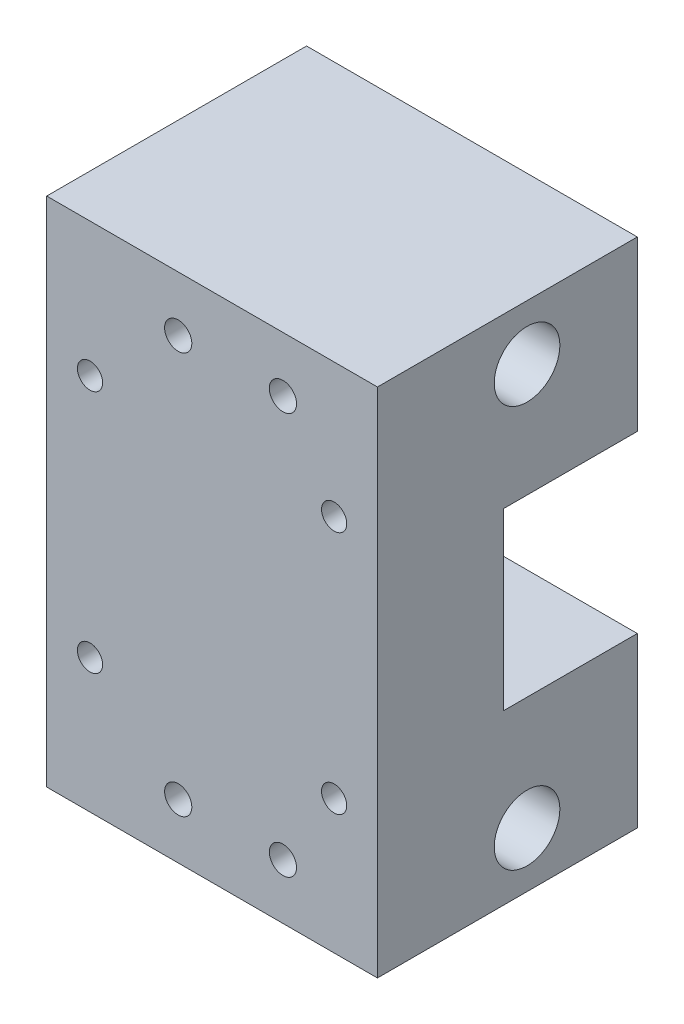
ISO-10303-21;
HEADER;
FILE_DESCRIPTION(('STEP AP214'),'2;1');
FILE_NAME('part.step','',(''),(''),'','','');
FILE_SCHEMA(('AUTOMOTIVE_DESIGN { 1 0 10303 214 1 1 1 1 }'));
ENDSEC;
DATA;
#1=APPLICATION_CONTEXT('core data for automotive mechanical design processes');
#2=APPLICATION_PROTOCOL_DEFINITION('international standard','automotive_design',2000,#1);
#3=PRODUCT_CONTEXT('',#1,'mechanical');
#4=PRODUCT('Part','Part','',(#3));
#5=PRODUCT_RELATED_PRODUCT_CATEGORY('part','',(#4));
#6=PRODUCT_DEFINITION_FORMATION('','',#4);
#7=PRODUCT_DEFINITION_CONTEXT('part definition',#1,'design');
#8=PRODUCT_DEFINITION('design','',#6,#7);
#9=PRODUCT_DEFINITION_SHAPE('','',#8);
#10=(LENGTH_UNIT() NAMED_UNIT(*) SI_UNIT(.MILLI.,.METRE.));
#11=(NAMED_UNIT(*) PLANE_ANGLE_UNIT() SI_UNIT($,.RADIAN.));
#12=(NAMED_UNIT(*) SI_UNIT($,.STERADIAN.) SOLID_ANGLE_UNIT());
#13=UNCERTAINTY_MEASURE_WITH_UNIT(LENGTH_MEASURE(1.E-05),#10,'distance_accuracy_value','');
#14=(GEOMETRIC_REPRESENTATION_CONTEXT(3) GLOBAL_UNCERTAINTY_ASSIGNED_CONTEXT((#13)) GLOBAL_UNIT_ASSIGNED_CONTEXT((#10,
#11,#12)) REPRESENTATION_CONTEXT('',''));
#15=CARTESIAN_POINT('',(0.,0.,0.));
#16=DIRECTION('',(0.,0.,1.));
#17=DIRECTION('',(1.,0.,0.));
#18=AXIS2_PLACEMENT_3D('',#15,#16,#17);
#19=CARTESIAN_POINT('',(21.,32.5,17.));
#20=DIRECTION('',(0.,0.,1.));
#21=DIRECTION('',(1.,0.,0.));
#22=AXIS2_PLACEMENT_3D('',#19,#20,#21);
#23=CYLINDRICAL_SURFACE('',#22,5.5);
#24=CARTESIAN_POINT('',(21.,32.5,17.));
#25=DIRECTION('',(0.,0.,1.));
#26=DIRECTION('',(1.,0.,0.));
#27=AXIS2_PLACEMENT_3D('',#24,#25,#26);
#28=CIRCLE('',#27,5.5);
#29=CARTESIAN_POINT('',(26.5,32.5,17.));
#30=VERTEX_POINT('',#29);
#31=EDGE_CURVE('E135',#30,#30,#28,.T.);
#32=ORIENTED_EDGE('',*,*,#31,.F.);
#33=EDGE_LOOP('',(#32));
#34=FACE_BOUND('',#33,.T.);
#35=CARTESIAN_POINT('',(21.,32.5,29.));
#36=DIRECTION('',(0.,0.,1.));
#37=DIRECTION('',(1.,0.,0.));
#38=AXIS2_PLACEMENT_3D('',#35,#36,#37);
#39=CIRCLE('',#38,5.5);
#40=CARTESIAN_POINT('',(26.5,32.5,29.));
#41=VERTEX_POINT('',#40);
#42=EDGE_CURVE('E11',#41,#41,#39,.F.);
#43=ORIENTED_EDGE('',*,*,#42,.F.);
#44=EDGE_LOOP('',(#43));
#45=FACE_BOUND('',#44,.T.);
#46=ADVANCED_FACE('F33',(#34,#45),#23,.F.);
#47=CARTESIAN_POINT('',(0.,0.,0.));
#48=DIRECTION('',(0.,0.,1.));
#49=DIRECTION('',(1.,0.,0.));
#50=AXIS2_PLACEMENT_3D('',#47,#48,#49);
#51=PLANE('',#50);
#52=CARTESIAN_POINT('',(36.5,17.,0.));
#53=DIRECTION('',(0.,0.,-1.));
#54=DIRECTION('',(-1.,0.,0.));
#55=AXIS2_PLACEMENT_3D('',#52,#53,#54);
#56=CIRCLE('',#55,3.);
#57=CARTESIAN_POINT('',(33.5,17.,0.));
#58=VERTEX_POINT('',#57);
#59=EDGE_CURVE('E326',#58,#58,#56,.T.);
#60=ORIENTED_EDGE('',*,*,#59,.F.);
#61=EDGE_LOOP('',(#60));
#62=FACE_BOUND('',#61,.T.);
#63=CARTESIAN_POINT('',(30.,7.,0.));
#64=DIRECTION('',(0.,0.,-1.));
#65=DIRECTION('',(-1.,0.,0.));
#66=AXIS2_PLACEMENT_3D('',#63,#64,#65);
#67=CIRCLE('',#66,1.72719999999998);
#68=CARTESIAN_POINT('',(28.2728,7.,0.));
#69=VERTEX_POINT('',#68);
#70=EDGE_CURVE('E290',#69,#69,#67,.T.);
#71=ORIENTED_EDGE('',*,*,#70,.F.);
#72=EDGE_LOOP('',(#71));
#73=FACE_BOUND('',#72,.T.);
#74=CARTESIAN_POINT('',(16.7,7.,0.));
#75=DIRECTION('',(0.,0.,-1.));
#76=DIRECTION('',(-1.,0.,0.));
#77=AXIS2_PLACEMENT_3D('',#74,#75,#76);
#78=CIRCLE('',#77,1.72719999999998);
#79=CARTESIAN_POINT('',(14.9728,7.,0.));
#80=VERTEX_POINT('',#79);
#81=EDGE_CURVE('E287',#80,#80,#78,.T.);
#82=ORIENTED_EDGE('',*,*,#81,.F.);
#83=EDGE_LOOP('',(#82));
#84=FACE_BOUND('',#83,.T.);
#85=DIRECTION('',(0.,-1.,0.));
#86=VECTOR('',#85,1.);
#87=CARTESIAN_POINT('',(0.,65.,0.));
#88=LINE('',#87,#86);
#89=CARTESIAN_POINT('',(0.,21.3875,0.));
#90=VERTEX_POINT('',#89);
#91=CARTESIAN_POINT('',(0.,0.,0.));
#92=VERTEX_POINT('',#91);
#93=EDGE_CURVE('E106',#90,#92,#88,.T.);
#94=ORIENTED_EDGE('',*,*,#93,.F.);
#95=DIRECTION('',(1.,0.,0.));
#96=VECTOR('',#95,1.);
#97=CARTESIAN_POINT('',(0.,21.3875,0.));
#98=LINE('',#97,#96);
#99=CARTESIAN_POINT('',(42.,21.3875,0.));
#100=VERTEX_POINT('',#99);
#101=EDGE_CURVE('E259',#90,#100,#98,.T.);
#102=ORIENTED_EDGE('',*,*,#101,.T.);
#103=DIRECTION('',(0.,1.,0.));
#104=VECTOR('',#103,1.);
#105=CARTESIAN_POINT('',(42.,0.,0.));
#106=LINE('',#105,#104);
#107=CARTESIAN_POINT('',(42.,0.,0.));
#108=VERTEX_POINT('',#107);
#109=EDGE_CURVE('E244',#108,#100,#106,.T.);
#110=ORIENTED_EDGE('',*,*,#109,.F.);
#111=DIRECTION('',(1.,0.,0.));
#112=VECTOR('',#111,1.);
#113=CARTESIAN_POINT('',(0.,0.,0.));
#114=LINE('',#113,#112);
#115=EDGE_CURVE('E250',#92,#108,#114,.T.);
#116=ORIENTED_EDGE('',*,*,#115,.F.);
#117=EDGE_LOOP('',(#94,#102,#110,#116));
#118=FACE_BOUND('',#117,.T.);
#119=CARTESIAN_POINT('',(5.5,17.,0.));
#120=DIRECTION('',(0.,0.,-1.));
#121=DIRECTION('',(-1.,0.,0.));
#122=AXIS2_PLACEMENT_3D('',#119,#120,#121);
#123=CIRCLE('',#122,3.);
#124=CARTESIAN_POINT('',(2.5,17.,0.));
#125=VERTEX_POINT('',#124);
#126=EDGE_CURVE('E317',#125,#125,#123,.T.);
#127=ORIENTED_EDGE('',*,*,#126,.F.);
#128=EDGE_LOOP('',(#127));
#129=FACE_BOUND('',#128,.T.);
#130=ADVANCED_FACE('F163',(#62,#73,#84,#118,#129),#51,.F.);
#131=CARTESIAN_POINT('',(42.,65.,0.));
#132=DIRECTION('',(0.,1.,0.));
#133=DIRECTION('',(0.,0.,1.));
#134=AXIS2_PLACEMENT_3D('',#131,#132,#133);
#135=PLANE('',#134);
#136=DIRECTION('',(0.,0.,1.));
#137=VECTOR('',#136,1.);
#138=CARTESIAN_POINT('',(0.,65.,0.));
#139=LINE('',#138,#137);
#140=CARTESIAN_POINT('',(0.,65.,0.));
#141=VERTEX_POINT('',#140);
#142=CARTESIAN_POINT('',(0.,65.,33.));
#143=VERTEX_POINT('',#142);
#144=EDGE_CURVE('E111',#141,#143,#139,.T.);
#145=ORIENTED_EDGE('',*,*,#144,.T.);
#146=DIRECTION('',(-1.,0.,0.));
#147=VECTOR('',#146,1.);
#148=CARTESIAN_POINT('',(0.,65.,33.));
#149=LINE('',#148,#147);
#150=CARTESIAN_POINT('',(42.,65.,33.));
#151=VERTEX_POINT('',#150);
#152=EDGE_CURVE('E125',#151,#143,#149,.T.);
#153=ORIENTED_EDGE('',*,*,#152,.F.);
#154=DIRECTION('',(0.,0.,1.));
#155=VECTOR('',#154,1.);
#156=CARTESIAN_POINT('',(42.,65.,0.));
#157=LINE('',#156,#155);
#158=CARTESIAN_POINT('',(42.,65.,0.));
#159=VERTEX_POINT('',#158);
#160=EDGE_CURVE('E41',#159,#151,#157,.T.);
#161=ORIENTED_EDGE('',*,*,#160,.F.);
#162=DIRECTION('',(-1.,0.,0.));
#163=VECTOR('',#162,1.);
#164=CARTESIAN_POINT('',(42.,65.,0.));
#165=LINE('',#164,#163);
#166=EDGE_CURVE('E255',#159,#141,#165,.T.);
#167=ORIENTED_EDGE('',*,*,#166,.T.);
#168=EDGE_LOOP('',(#145,#153,#161,#167));
#169=FACE_BOUND('',#168,.T.);
#170=ADVANCED_FACE('F35',(#169),#135,.T.);
#171=CARTESIAN_POINT('',(42.,0.,0.));
#172=DIRECTION('',(1.,0.,0.));
#173=DIRECTION('',(0.,0.,-1.));
#174=AXIS2_PLACEMENT_3D('',#171,#172,#173);
#175=PLANE('',#174);
#176=CARTESIAN_POINT('',(42.,7.,14.));
#177=DIRECTION('',(1.,0.,0.));
#178=DIRECTION('',(0.,0.,-1.));
#179=AXIS2_PLACEMENT_3D('',#176,#177,#178);
#180=CIRCLE('',#179,4.16718750000001);
#181=CARTESIAN_POINT('',(42.,7.,9.83281249999999));
#182=VERTEX_POINT('',#181);
#183=EDGE_CURVE('E337',#182,#182,#180,.T.);
#184=ORIENTED_EDGE('',*,*,#183,.F.);
#185=EDGE_LOOP('',(#184));
#186=FACE_BOUND('',#185,.T.);
#187=CARTESIAN_POINT('',(42.,58.,14.));
#188=DIRECTION('',(1.,0.,0.));
#189=DIRECTION('',(0.,0.,-1.));
#190=AXIS2_PLACEMENT_3D('',#187,#188,#189);
#191=CIRCLE('',#190,4.16718750000002);
#192=CARTESIAN_POINT('',(42.,58.,9.83281249999998));
#193=VERTEX_POINT('',#192);
#194=EDGE_CURVE('E332',#193,#193,#191,.T.);
#195=ORIENTED_EDGE('',*,*,#194,.F.);
#196=EDGE_LOOP('',(#195));
#197=FACE_BOUND('',#196,.T.);
#198=DIRECTION('',(0.,0.,-1.));
#199=VECTOR('',#198,1.);
#200=CARTESIAN_POINT('',(42.,21.3875,17.));
#201=LINE('',#200,#199);
#202=CARTESIAN_POINT('',(42.,21.3875,17.));
#203=VERTEX_POINT('',#202);
#204=EDGE_CURVE('E274',#203,#100,#201,.T.);
#205=ORIENTED_EDGE('',*,*,#204,.F.);
#206=DIRECTION('',(0.,-1.,0.));
#207=VECTOR('',#206,1.);
#208=CARTESIAN_POINT('',(42.,43.6125,17.));
#209=LINE('',#208,#207);
#210=CARTESIAN_POINT('',(42.,43.6125,17.));
#211=VERTEX_POINT('',#210);
#212=EDGE_CURVE('E267',#211,#203,#209,.T.);
#213=ORIENTED_EDGE('',*,*,#212,.F.);
#214=DIRECTION('',(0.,0.,1.));
#215=VECTOR('',#214,1.);
#216=CARTESIAN_POINT('',(42.,43.6125,0.));
#217=LINE('',#216,#215);
#218=CARTESIAN_POINT('',(42.,43.6125,0.));
#219=VERTEX_POINT('',#218);
#220=EDGE_CURVE('E271',#219,#211,#217,.T.);
#221=ORIENTED_EDGE('',*,*,#220,.F.);
#222=EDGE_CURVE('E56',#219,#159,#106,.T.);
#223=ORIENTED_EDGE('',*,*,#222,.T.);
#224=ORIENTED_EDGE('',*,*,#160,.T.);
#225=DIRECTION('',(0.,1.,0.));
#226=VECTOR('',#225,1.);
#227=CARTESIAN_POINT('',(42.,0.,33.));
#228=LINE('',#227,#226);
#229=CARTESIAN_POINT('',(42.,0.,33.));
#230=VERTEX_POINT('',#229);
#231=EDGE_CURVE('E119',#230,#151,#228,.T.);
#232=ORIENTED_EDGE('',*,*,#231,.F.);
#233=DIRECTION('',(0.,0.,1.));
#234=VECTOR('',#233,1.);
#235=CARTESIAN_POINT('',(42.,0.,0.));
#236=LINE('',#235,#234);
#237=EDGE_CURVE('E110',#108,#230,#236,.T.);
#238=ORIENTED_EDGE('',*,*,#237,.F.);
#239=ORIENTED_EDGE('',*,*,#109,.T.);
#240=EDGE_LOOP('',(#205,#213,#221,#223,#224,#232,#238,#239));
#241=FACE_BOUND('',#240,.T.);
#242=ADVANCED_FACE('F410',(#186,#197,#241),#175,.T.);
#243=CARTESIAN_POINT('',(0.,0.,0.));
#244=DIRECTION('',(0.,-1.,0.));
#245=DIRECTION('',(0.,0.,-1.));
#246=AXIS2_PLACEMENT_3D('',#243,#244,#245);
#247=PLANE('',#246);
#248=ORIENTED_EDGE('',*,*,#237,.T.);
#249=DIRECTION('',(1.,0.,0.));
#250=VECTOR('',#249,1.);
#251=CARTESIAN_POINT('',(0.,0.,33.));
#252=LINE('',#251,#250);
#253=CARTESIAN_POINT('',(0.,0.,33.));
#254=VERTEX_POINT('',#253);
#255=EDGE_CURVE('E114',#254,#230,#252,.T.);
#256=ORIENTED_EDGE('',*,*,#255,.F.);
#257=DIRECTION('',(0.,0.,1.));
#258=VECTOR('',#257,1.);
#259=CARTESIAN_POINT('',(0.,0.,0.));
#260=LINE('',#259,#258);
#261=EDGE_CURVE('E99',#92,#254,#260,.T.);
#262=ORIENTED_EDGE('',*,*,#261,.F.);
#263=ORIENTED_EDGE('',*,*,#115,.T.);
#264=EDGE_LOOP('',(#248,#256,#262,#263));
#265=FACE_BOUND('',#264,.T.);
#266=ADVANCED_FACE('F115',(#265),#247,.T.);
#267=CARTESIAN_POINT('',(0.,65.,0.));
#268=DIRECTION('',(-1.,0.,0.));
#269=DIRECTION('',(0.,-1.,0.));
#270=AXIS2_PLACEMENT_3D('',#267,#268,#269);
#271=PLANE('',#270);
#272=DIRECTION('',(0.,0.,-1.));
#273=VECTOR('',#272,1.);
#274=CARTESIAN_POINT('',(0.,21.3875,17.));
#275=LINE('',#274,#273);
#276=CARTESIAN_POINT('',(0.,21.3875,17.));
#277=VERTEX_POINT('',#276);
#278=EDGE_CURVE('E270',#277,#90,#275,.T.);
#279=ORIENTED_EDGE('',*,*,#278,.T.);
#280=ORIENTED_EDGE('',*,*,#93,.T.);
#281=ORIENTED_EDGE('',*,*,#261,.T.);
#282=DIRECTION('',(0.,-1.,0.));
#283=VECTOR('',#282,1.);
#284=CARTESIAN_POINT('',(0.,0.,33.));
#285=LINE('',#284,#283);
#286=EDGE_CURVE('E104',#143,#254,#285,.T.);
#287=ORIENTED_EDGE('',*,*,#286,.F.);
#288=ORIENTED_EDGE('',*,*,#144,.F.);
#289=CARTESIAN_POINT('',(0.,43.6125,0.));
#290=VERTEX_POINT('',#289);
#291=EDGE_CURVE('E252',#141,#290,#88,.T.);
#292=ORIENTED_EDGE('',*,*,#291,.T.);
#293=DIRECTION('',(0.,0.,1.));
#294=VECTOR('',#293,1.);
#295=CARTESIAN_POINT('',(0.,43.6125,0.));
#296=LINE('',#295,#294);
#297=CARTESIAN_POINT('',(0.,43.6125,17.));
#298=VERTEX_POINT('',#297);
#299=EDGE_CURVE('E48',#290,#298,#296,.T.);
#300=ORIENTED_EDGE('',*,*,#299,.T.);
#301=DIRECTION('',(0.,-1.,0.));
#302=VECTOR('',#301,1.);
#303=CARTESIAN_POINT('',(0.,43.6125,17.));
#304=LINE('',#303,#302);
#305=EDGE_CURVE('E262',#298,#277,#304,.T.);
#306=ORIENTED_EDGE('',*,*,#305,.T.);
#307=EDGE_LOOP('',(#279,#280,#281,#287,#288,#292,#300,#306));
#308=FACE_BOUND('',#307,.T.);
#309=ADVANCED_FACE('F102',(#308),#271,.T.);
#310=CARTESIAN_POINT('',(5.5,48.,0.));
#311=DIRECTION('',(0.,0.,-1.));
#312=DIRECTION('',(-1.,0.,0.));
#313=AXIS2_PLACEMENT_3D('',#310,#311,#312);
#314=CIRCLE('',#313,3.);
#315=CARTESIAN_POINT('',(2.5,48.,0.));
#316=VERTEX_POINT('',#315);
#317=EDGE_CURVE('E308',#316,#316,#314,.T.);
#318=ORIENTED_EDGE('',*,*,#317,.F.);
#319=EDGE_LOOP('',(#318));
#320=FACE_BOUND('',#319,.T.);
#321=CARTESIAN_POINT('',(36.5,48.,0.));
#322=DIRECTION('',(0.,0.,-1.));
#323=DIRECTION('',(-1.,0.,0.));
#324=AXIS2_PLACEMENT_3D('',#321,#322,#323);
#325=CIRCLE('',#324,3.);
#326=CARTESIAN_POINT('',(33.5,48.,0.));
#327=VERTEX_POINT('',#326);
#328=EDGE_CURVE('E299',#327,#327,#325,.T.);
#329=ORIENTED_EDGE('',*,*,#328,.F.);
#330=EDGE_LOOP('',(#329));
#331=FACE_BOUND('',#330,.T.);
#332=CARTESIAN_POINT('',(16.7,58.,0.));
#333=DIRECTION('',(0.,0.,-1.));
#334=DIRECTION('',(-1.,0.,0.));
#335=AXIS2_PLACEMENT_3D('',#332,#333,#334);
#336=CIRCLE('',#335,1.72719999999998);
#337=CARTESIAN_POINT('',(14.9728,58.,0.));
#338=VERTEX_POINT('',#337);
#339=EDGE_CURVE('E284',#338,#338,#336,.T.);
#340=ORIENTED_EDGE('',*,*,#339,.F.);
#341=EDGE_LOOP('',(#340));
#342=FACE_BOUND('',#341,.T.);
#343=CARTESIAN_POINT('',(30.,58.,0.));
#344=DIRECTION('',(0.,0.,-1.));
#345=DIRECTION('',(-1.,0.,0.));
#346=AXIS2_PLACEMENT_3D('',#343,#344,#345);
#347=CIRCLE('',#346,1.72719999999998);
#348=CARTESIAN_POINT('',(28.2728,58.,0.));
#349=VERTEX_POINT('',#348);
#350=EDGE_CURVE('E277',#349,#349,#347,.T.);
#351=ORIENTED_EDGE('',*,*,#350,.F.);
#352=EDGE_LOOP('',(#351));
#353=FACE_BOUND('',#352,.T.);
#354=ORIENTED_EDGE('',*,*,#222,.F.);
#355=DIRECTION('',(1.,0.,0.));
#356=VECTOR('',#355,1.);
#357=CARTESIAN_POINT('',(0.,43.6125,0.));
#358=LINE('',#357,#356);
#359=EDGE_CURVE('E261',#290,#219,#358,.T.);
#360=ORIENTED_EDGE('',*,*,#359,.F.);
#361=ORIENTED_EDGE('',*,*,#291,.F.);
#362=ORIENTED_EDGE('',*,*,#166,.F.);
#363=EDGE_LOOP('',(#354,#360,#361,#362));
#364=FACE_BOUND('',#363,.T.);
#365=ADVANCED_FACE('F404',(#320,#331,#342,#353,#364),#51,.F.);
#366=CARTESIAN_POINT('',(0.,21.3875,17.));
#367=DIRECTION('',(0.,-1.,0.));
#368=DIRECTION('',(0.,0.,-1.));
#369=AXIS2_PLACEMENT_3D('',#366,#367,#368);
#370=PLANE('',#369);
#371=ORIENTED_EDGE('',*,*,#204,.T.);
#372=ORIENTED_EDGE('',*,*,#101,.F.);
#373=ORIENTED_EDGE('',*,*,#278,.F.);
#374=DIRECTION('',(1.,0.,0.));
#375=VECTOR('',#374,1.);
#376=CARTESIAN_POINT('',(0.,21.3875,17.));
#377=LINE('',#376,#375);
#378=EDGE_CURVE('E258',#277,#203,#377,.T.);
#379=ORIENTED_EDGE('',*,*,#378,.T.);
#380=EDGE_LOOP('',(#371,#372,#373,#379));
#381=FACE_BOUND('',#380,.T.);
#382=ADVANCED_FACE('F497',(#381),#370,.F.);
#383=CARTESIAN_POINT('',(0.,43.6125,17.));
#384=DIRECTION('',(0.,0.,1.));
#385=DIRECTION('',(1.,0.,0.));
#386=AXIS2_PLACEMENT_3D('',#383,#384,#385);
#387=PLANE('',#386);
#388=ORIENTED_EDGE('',*,*,#212,.T.);
#389=ORIENTED_EDGE('',*,*,#378,.F.);
#390=ORIENTED_EDGE('',*,*,#305,.F.);
#391=DIRECTION('',(1.,0.,0.));
#392=VECTOR('',#391,1.);
#393=CARTESIAN_POINT('',(0.,43.6125,17.));
#394=LINE('',#393,#392);
#395=EDGE_CURVE('E264',#298,#211,#394,.T.);
#396=ORIENTED_EDGE('',*,*,#395,.T.);
#397=EDGE_LOOP('',(#388,#389,#390,#396));
#398=FACE_BOUND('',#397,.T.);
#399=ORIENTED_EDGE('',*,*,#31,.T.);
#400=EDGE_LOOP('',(#399));
#401=FACE_BOUND('',#400,.T.);
#402=ADVANCED_FACE('F344',(#398,#401),#387,.F.);
#403=CARTESIAN_POINT('',(0.,43.6125,0.));
#404=DIRECTION('',(0.,1.,0.));
#405=DIRECTION('',(0.,0.,1.));
#406=AXIS2_PLACEMENT_3D('',#403,#404,#405);
#407=PLANE('',#406);
#408=ORIENTED_EDGE('',*,*,#359,.T.);
#409=ORIENTED_EDGE('',*,*,#220,.T.);
#410=ORIENTED_EDGE('',*,*,#395,.F.);
#411=ORIENTED_EDGE('',*,*,#299,.F.);
#412=EDGE_LOOP('',(#408,#409,#410,#411));
#413=FACE_BOUND('',#412,.T.);
#414=ADVANCED_FACE('F396',(#413),#407,.F.);
#415=CARTESIAN_POINT('',(30.,58.,0.));
#416=DIRECTION('',(0.,0.,-1.));
#417=DIRECTION('',(-1.,0.,0.));
#418=AXIS2_PLACEMENT_3D('',#415,#416,#417);
#419=CYLINDRICAL_SURFACE('',#418,1.72719999999998);
#420=ORIENTED_EDGE('',*,*,#350,.T.);
#421=EDGE_LOOP('',(#420));
#422=FACE_BOUND('',#421,.T.);
#423=CARTESIAN_POINT('',(30.,58.,33.));
#424=DIRECTION('',(0.,0.,1.));
#425=DIRECTION('',(1.,0.,0.));
#426=AXIS2_PLACEMENT_3D('',#423,#424,#425);
#427=CIRCLE('',#426,1.72719999999999);
#428=CARTESIAN_POINT('',(31.7272,58.,33.));
#429=VERTEX_POINT('',#428);
#430=EDGE_CURVE('E659',#429,#429,#427,.T.);
#431=ORIENTED_EDGE('',*,*,#430,.T.);
#432=EDGE_LOOP('',(#431));
#433=FACE_BOUND('',#432,.T.);
#434=ADVANCED_FACE('F389',(#422,#433),#419,.F.);
#435=CARTESIAN_POINT('',(16.7,58.,0.));
#436=DIRECTION('',(0.,0.,-1.));
#437=DIRECTION('',(-1.,0.,0.));
#438=AXIS2_PLACEMENT_3D('',#435,#436,#437);
#439=CYLINDRICAL_SURFACE('',#438,1.72719999999998);
#440=ORIENTED_EDGE('',*,*,#339,.T.);
#441=EDGE_LOOP('',(#440));
#442=FACE_BOUND('',#441,.T.);
#443=CARTESIAN_POINT('',(16.7,58.,33.));
#444=DIRECTION('',(0.,0.,1.));
#445=DIRECTION('',(1.,0.,0.));
#446=AXIS2_PLACEMENT_3D('',#443,#444,#445);
#447=CIRCLE('',#446,1.72719999999998);
#448=CARTESIAN_POINT('',(18.4272,58.,33.));
#449=VERTEX_POINT('',#448);
#450=EDGE_CURVE('E129',#449,#449,#447,.T.);
#451=ORIENTED_EDGE('',*,*,#450,.T.);
#452=EDGE_LOOP('',(#451));
#453=FACE_BOUND('',#452,.T.);
#454=ADVANCED_FACE('F382',(#442,#453),#439,.F.);
#455=CARTESIAN_POINT('',(16.7,7.,0.));
#456=DIRECTION('',(0.,0.,-1.));
#457=DIRECTION('',(-1.,0.,0.));
#458=AXIS2_PLACEMENT_3D('',#455,#456,#457);
#459=CYLINDRICAL_SURFACE('',#458,1.72719999999998);
#460=ORIENTED_EDGE('',*,*,#81,.T.);
#461=EDGE_LOOP('',(#460));
#462=FACE_BOUND('',#461,.T.);
#463=CARTESIAN_POINT('',(16.7,7.,33.));
#464=DIRECTION('',(0.,0.,1.));
#465=DIRECTION('',(1.,0.,0.));
#466=AXIS2_PLACEMENT_3D('',#463,#464,#465);
#467=CIRCLE('',#466,1.72719999999999);
#468=CARTESIAN_POINT('',(18.4272,7.,33.));
#469=VERTEX_POINT('',#468);
#470=EDGE_CURVE('E643',#469,#469,#467,.T.);
#471=ORIENTED_EDGE('',*,*,#470,.T.);
#472=EDGE_LOOP('',(#471));
#473=FACE_BOUND('',#472,.T.);
#474=ADVANCED_FACE('F232',(#462,#473),#459,.F.);
#475=CARTESIAN_POINT('',(30.,7.,0.));
#476=DIRECTION('',(0.,0.,-1.));
#477=DIRECTION('',(-1.,0.,0.));
#478=AXIS2_PLACEMENT_3D('',#475,#476,#477);
#479=CYLINDRICAL_SURFACE('',#478,1.72719999999998);
#480=CARTESIAN_POINT('',(30.,7.,21.));
#481=DIRECTION('',(0.,0.,-1.));
#482=DIRECTION('',(1.,0.,0.));
#483=AXIS2_PLACEMENT_3D('',#480,#481,#482);
#484=CIRCLE('',#483,1.72819691868454);
#485=CARTESIAN_POINT('',(31.7281969186845,7.,21.));
#486=VERTEX_POINT('',#485);
#487=EDGE_CURVE('E140',#486,#486,#484,.T.);
#488=ORIENTED_EDGE('',*,*,#487,.F.);
#489=EDGE_LOOP('',(#488));
#490=FACE_BOUND('',#489,.T.);
#491=ORIENTED_EDGE('',*,*,#70,.T.);
#492=EDGE_LOOP('',(#491));
#493=FACE_BOUND('',#492,.T.);
#494=ADVANCED_FACE('F227',(#490,#493),#479,.F.);
#495=CARTESIAN_POINT('',(36.5,48.,0.));
#496=DIRECTION('',(0.,0.,-1.));
#497=DIRECTION('',(-1.,0.,0.));
#498=AXIS2_PLACEMENT_3D('',#495,#496,#497);
#499=CYLINDRICAL_SURFACE('',#498,1.60000000000001);
#500=CARTESIAN_POINT('',(36.5,48.,7.62));
#501=DIRECTION('',(0.,0.,-1.));
#502=DIRECTION('',(-1.,0.,0.));
#503=AXIS2_PLACEMENT_3D('',#500,#501,#502);
#504=CIRCLE('',#503,1.60000000000001);
#505=CARTESIAN_POINT('',(34.9,48.,7.62));
#506=VERTEX_POINT('',#505);
#507=EDGE_CURVE('E293',#506,#506,#504,.T.);
#508=ORIENTED_EDGE('',*,*,#507,.T.);
#509=EDGE_LOOP('',(#508));
#510=FACE_BOUND('',#509,.T.);
#511=CARTESIAN_POINT('',(36.5,48.,33.));
#512=DIRECTION('',(0.,0.,1.));
#513=DIRECTION('',(1.,0.,0.));
#514=AXIS2_PLACEMENT_3D('',#511,#512,#513);
#515=CIRCLE('',#514,1.60000000000001);
#516=CARTESIAN_POINT('',(38.1,48.,33.));
#517=VERTEX_POINT('',#516);
#518=EDGE_CURVE('E656',#517,#517,#515,.T.);
#519=ORIENTED_EDGE('',*,*,#518,.T.);
#520=EDGE_LOOP('',(#519));
#521=FACE_BOUND('',#520,.T.);
#522=ADVANCED_FACE('F223',(#510,#521),#499,.F.);
#523=CARTESIAN_POINT('',(38.1,48.,7.62));
#524=DIRECTION('',(0.,0.,1.));
#525=DIRECTION('',(1.,0.,0.));
#526=AXIS2_PLACEMENT_3D('',#523,#524,#525);
#527=PLANE('',#526);
#528=ORIENTED_EDGE('',*,*,#507,.F.);
#529=EDGE_LOOP('',(#528));
#530=FACE_BOUND('',#529,.T.);
#531=CARTESIAN_POINT('',(36.5,48.,7.62));
#532=DIRECTION('',(0.,0.,-1.));
#533=DIRECTION('',(-1.,0.,0.));
#534=AXIS2_PLACEMENT_3D('',#531,#532,#533);
#535=CIRCLE('',#534,3.);
#536=CARTESIAN_POINT('',(33.5,48.,7.62));
#537=VERTEX_POINT('',#536);
#538=EDGE_CURVE('E296',#537,#537,#535,.T.);
#539=ORIENTED_EDGE('',*,*,#538,.T.);
#540=EDGE_LOOP('',(#539));
#541=FACE_BOUND('',#540,.T.);
#542=ADVANCED_FACE('F219',(#530,#541),#527,.F.);
#543=CARTESIAN_POINT('',(36.5,48.,0.));
#544=DIRECTION('',(0.,0.,-1.));
#545=DIRECTION('',(-1.,0.,0.));
#546=AXIS2_PLACEMENT_3D('',#543,#544,#545);
#547=CYLINDRICAL_SURFACE('',#546,3.);
#548=ORIENTED_EDGE('',*,*,#538,.F.);
#549=EDGE_LOOP('',(#548));
#550=FACE_BOUND('',#549,.T.);
#551=ORIENTED_EDGE('',*,*,#328,.T.);
#552=EDGE_LOOP('',(#551));
#553=FACE_BOUND('',#552,.T.);
#554=ADVANCED_FACE('F215',(#550,#553),#547,.F.);
#555=CARTESIAN_POINT('',(5.5,48.,0.));
#556=DIRECTION('',(0.,0.,-1.));
#557=DIRECTION('',(-1.,0.,0.));
#558=AXIS2_PLACEMENT_3D('',#555,#556,#557);
#559=CYLINDRICAL_SURFACE('',#558,1.6);
#560=CARTESIAN_POINT('',(5.5,48.,7.62));
#561=DIRECTION('',(0.,0.,-1.));
#562=DIRECTION('',(-1.,0.,0.));
#563=AXIS2_PLACEMENT_3D('',#560,#561,#562);
#564=CIRCLE('',#563,1.60000000000001);
#565=CARTESIAN_POINT('',(3.89999999999999,48.,7.62));
#566=VERTEX_POINT('',#565);
#567=EDGE_CURVE('E302',#566,#566,#564,.T.);
#568=ORIENTED_EDGE('',*,*,#567,.T.);
#569=EDGE_LOOP('',(#568));
#570=FACE_BOUND('',#569,.T.);
#571=CARTESIAN_POINT('',(5.5,48.,33.));
#572=DIRECTION('',(0.,0.,1.));
#573=DIRECTION('',(1.,0.,0.));
#574=AXIS2_PLACEMENT_3D('',#571,#572,#573);
#575=CIRCLE('',#574,1.6);
#576=CARTESIAN_POINT('',(7.1,48.,33.));
#577=VERTEX_POINT('',#576);
#578=EDGE_CURVE('E126',#577,#577,#575,.T.);
#579=ORIENTED_EDGE('',*,*,#578,.T.);
#580=EDGE_LOOP('',(#579));
#581=FACE_BOUND('',#580,.T.);
#582=ADVANCED_FACE('F211',(#570,#581),#559,.F.);
#583=CARTESIAN_POINT('',(7.10000000000001,48.,7.62));
#584=DIRECTION('',(0.,0.,1.));
#585=DIRECTION('',(1.,0.,0.));
#586=AXIS2_PLACEMENT_3D('',#583,#584,#585);
#587=PLANE('',#586);
#588=ORIENTED_EDGE('',*,*,#567,.F.);
#589=EDGE_LOOP('',(#588));
#590=FACE_BOUND('',#589,.T.);
#591=CARTESIAN_POINT('',(5.5,48.,7.62));
#592=DIRECTION('',(0.,0.,-1.));
#593=DIRECTION('',(-1.,0.,0.));
#594=AXIS2_PLACEMENT_3D('',#591,#592,#593);
#595=CIRCLE('',#594,3.);
#596=CARTESIAN_POINT('',(2.5,48.,7.62));
#597=VERTEX_POINT('',#596);
#598=EDGE_CURVE('E305',#597,#597,#595,.T.);
#599=ORIENTED_EDGE('',*,*,#598,.T.);
#600=EDGE_LOOP('',(#599));
#601=FACE_BOUND('',#600,.T.);
#602=ADVANCED_FACE('F207',(#590,#601),#587,.F.);
#603=CARTESIAN_POINT('',(5.5,48.,0.));
#604=DIRECTION('',(0.,0.,-1.));
#605=DIRECTION('',(-1.,0.,0.));
#606=AXIS2_PLACEMENT_3D('',#603,#604,#605);
#607=CYLINDRICAL_SURFACE('',#606,3.);
#608=ORIENTED_EDGE('',*,*,#598,.F.);
#609=EDGE_LOOP('',(#608));
#610=FACE_BOUND('',#609,.T.);
#611=ORIENTED_EDGE('',*,*,#317,.T.);
#612=EDGE_LOOP('',(#611));
#613=FACE_BOUND('',#612,.T.);
#614=ADVANCED_FACE('F203',(#610,#613),#607,.F.);
#615=CARTESIAN_POINT('',(5.5,17.,0.));
#616=DIRECTION('',(0.,0.,-1.));
#617=DIRECTION('',(-1.,0.,0.));
#618=AXIS2_PLACEMENT_3D('',#615,#616,#617);
#619=CYLINDRICAL_SURFACE('',#618,1.6);
#620=CARTESIAN_POINT('',(5.5,17.,7.62));
#621=DIRECTION('',(0.,0.,-1.));
#622=DIRECTION('',(-1.,0.,0.));
#623=AXIS2_PLACEMENT_3D('',#620,#621,#622);
#624=CIRCLE('',#623,1.60000000000001);
#625=CARTESIAN_POINT('',(3.89999999999999,17.,7.62));
#626=VERTEX_POINT('',#625);
#627=EDGE_CURVE('E311',#626,#626,#624,.T.);
#628=ORIENTED_EDGE('',*,*,#627,.T.);
#629=EDGE_LOOP('',(#628));
#630=FACE_BOUND('',#629,.T.);
#631=CARTESIAN_POINT('',(5.5,17.,33.));
#632=DIRECTION('',(0.,0.,1.));
#633=DIRECTION('',(1.,0.,0.));
#634=AXIS2_PLACEMENT_3D('',#631,#632,#633);
#635=CIRCLE('',#634,1.6);
#636=CARTESIAN_POINT('',(7.1,17.,33.));
#637=VERTEX_POINT('',#636);
#638=EDGE_CURVE('E645',#637,#637,#635,.T.);
#639=ORIENTED_EDGE('',*,*,#638,.T.);
#640=EDGE_LOOP('',(#639));
#641=FACE_BOUND('',#640,.T.);
#642=ADVANCED_FACE('F199',(#630,#641),#619,.F.);
#643=CARTESIAN_POINT('',(7.10000000000001,17.,7.62));
#644=DIRECTION('',(0.,0.,1.));
#645=DIRECTION('',(1.,0.,0.));
#646=AXIS2_PLACEMENT_3D('',#643,#644,#645);
#647=PLANE('',#646);
#648=ORIENTED_EDGE('',*,*,#627,.F.);
#649=EDGE_LOOP('',(#648));
#650=FACE_BOUND('',#649,.T.);
#651=CARTESIAN_POINT('',(5.5,17.,7.62));
#652=DIRECTION('',(0.,0.,-1.));
#653=DIRECTION('',(-1.,0.,0.));
#654=AXIS2_PLACEMENT_3D('',#651,#652,#653);
#655=CIRCLE('',#654,3.);
#656=CARTESIAN_POINT('',(2.5,17.,7.62));
#657=VERTEX_POINT('',#656);
#658=EDGE_CURVE('E314',#657,#657,#655,.T.);
#659=ORIENTED_EDGE('',*,*,#658,.T.);
#660=EDGE_LOOP('',(#659));
#661=FACE_BOUND('',#660,.T.);
#662=ADVANCED_FACE('F195',(#650,#661),#647,.F.);
#663=CARTESIAN_POINT('',(5.5,17.,0.));
#664=DIRECTION('',(0.,0.,-1.));
#665=DIRECTION('',(-1.,0.,0.));
#666=AXIS2_PLACEMENT_3D('',#663,#664,#665);
#667=CYLINDRICAL_SURFACE('',#666,3.);
#668=ORIENTED_EDGE('',*,*,#658,.F.);
#669=EDGE_LOOP('',(#668));
#670=FACE_BOUND('',#669,.T.);
#671=ORIENTED_EDGE('',*,*,#126,.T.);
#672=EDGE_LOOP('',(#671));
#673=FACE_BOUND('',#672,.T.);
#674=ADVANCED_FACE('F191',(#670,#673),#667,.F.);
#675=CARTESIAN_POINT('',(36.5,17.,0.));
#676=DIRECTION('',(0.,0.,-1.));
#677=DIRECTION('',(-1.,0.,0.));
#678=AXIS2_PLACEMENT_3D('',#675,#676,#677);
#679=CYLINDRICAL_SURFACE('',#678,1.60000000000001);
#680=CARTESIAN_POINT('',(36.5,17.,7.62));
#681=DIRECTION('',(0.,0.,-1.));
#682=DIRECTION('',(-1.,0.,0.));
#683=AXIS2_PLACEMENT_3D('',#680,#681,#682);
#684=CIRCLE('',#683,1.60000000000001);
#685=CARTESIAN_POINT('',(34.9,17.,7.62));
#686=VERTEX_POINT('',#685);
#687=EDGE_CURVE('E320',#686,#686,#684,.T.);
#688=ORIENTED_EDGE('',*,*,#687,.T.);
#689=EDGE_LOOP('',(#688));
#690=FACE_BOUND('',#689,.T.);
#691=CARTESIAN_POINT('',(36.5,17.,33.));
#692=DIRECTION('',(0.,0.,1.));
#693=DIRECTION('',(1.,0.,0.));
#694=AXIS2_PLACEMENT_3D('',#691,#692,#693);
#695=CIRCLE('',#694,1.6);
#696=CARTESIAN_POINT('',(38.1,17.,33.));
#697=VERTEX_POINT('',#696);
#698=EDGE_CURVE('E649',#697,#697,#695,.T.);
#699=ORIENTED_EDGE('',*,*,#698,.T.);
#700=EDGE_LOOP('',(#699));
#701=FACE_BOUND('',#700,.T.);
#702=ADVANCED_FACE('F187',(#690,#701),#679,.F.);
#703=CARTESIAN_POINT('',(38.1,17.,7.62));
#704=DIRECTION('',(0.,0.,1.));
#705=DIRECTION('',(1.,0.,0.));
#706=AXIS2_PLACEMENT_3D('',#703,#704,#705);
#707=PLANE('',#706);
#708=ORIENTED_EDGE('',*,*,#687,.F.);
#709=EDGE_LOOP('',(#708));
#710=FACE_BOUND('',#709,.T.);
#711=CARTESIAN_POINT('',(36.5,17.,7.62));
#712=DIRECTION('',(0.,0.,-1.));
#713=DIRECTION('',(-1.,0.,0.));
#714=AXIS2_PLACEMENT_3D('',#711,#712,#713);
#715=CIRCLE('',#714,3.);
#716=CARTESIAN_POINT('',(33.5,17.,7.62));
#717=VERTEX_POINT('',#716);
#718=EDGE_CURVE('E323',#717,#717,#715,.T.);
#719=ORIENTED_EDGE('',*,*,#718,.T.);
#720=EDGE_LOOP('',(#719));
#721=FACE_BOUND('',#720,.T.);
#722=ADVANCED_FACE('F183',(#710,#721),#707,.F.);
#723=CARTESIAN_POINT('',(36.5,17.,0.));
#724=DIRECTION('',(0.,0.,-1.));
#725=DIRECTION('',(-1.,0.,0.));
#726=AXIS2_PLACEMENT_3D('',#723,#724,#725);
#727=CYLINDRICAL_SURFACE('',#726,3.);
#728=ORIENTED_EDGE('',*,*,#718,.F.);
#729=EDGE_LOOP('',(#728));
#730=FACE_BOUND('',#729,.T.);
#731=ORIENTED_EDGE('',*,*,#59,.T.);
#732=EDGE_LOOP('',(#731));
#733=FACE_BOUND('',#732,.T.);
#734=ADVANCED_FACE('F179',(#730,#733),#727,.F.);
#735=CARTESIAN_POINT('',(34.,58.,14.));
#736=DIRECTION('',(-1.,0.,0.));
#737=DIRECTION('',(0.,0.,1.));
#738=AXIS2_PLACEMENT_3D('',#735,#736,#737);
#739=PLANE('',#738);
#740=CARTESIAN_POINT('',(34.,58.,14.));
#741=DIRECTION('',(1.,0.,0.));
#742=DIRECTION('',(0.,0.,-1.));
#743=AXIS2_PLACEMENT_3D('',#740,#741,#742);
#744=CIRCLE('',#743,4.16718750000002);
#745=CARTESIAN_POINT('',(34.,58.,9.83281249999998));
#746=VERTEX_POINT('',#745);
#747=EDGE_CURVE('E329',#746,#746,#744,.T.);
#748=ORIENTED_EDGE('',*,*,#747,.T.);
#749=EDGE_LOOP('',(#748));
#750=FACE_BOUND('',#749,.T.);
#751=ADVANCED_FACE('F175',(#750),#739,.F.);
#752=CARTESIAN_POINT('',(42.,58.,14.));
#753=DIRECTION('',(1.,0.,0.));
#754=DIRECTION('',(0.,0.,-1.));
#755=AXIS2_PLACEMENT_3D('',#752,#753,#754);
#756=CYLINDRICAL_SURFACE('',#755,4.16718750000002);
#757=ORIENTED_EDGE('',*,*,#747,.F.);
#758=EDGE_LOOP('',(#757));
#759=FACE_BOUND('',#758,.T.);
#760=ORIENTED_EDGE('',*,*,#194,.T.);
#761=EDGE_LOOP('',(#760));
#762=FACE_BOUND('',#761,.T.);
#763=ADVANCED_FACE('F171',(#759,#762),#756,.F.);
#764=CARTESIAN_POINT('',(34.,7.,14.));
#765=DIRECTION('',(-1.,0.,0.));
#766=DIRECTION('',(0.,0.,1.));
#767=AXIS2_PLACEMENT_3D('',#764,#765,#766);
#768=PLANE('',#767);
#769=CARTESIAN_POINT('',(34.,7.,14.));
#770=DIRECTION('',(1.,0.,0.));
#771=DIRECTION('',(0.,0.,-1.));
#772=AXIS2_PLACEMENT_3D('',#769,#770,#771);
#773=CIRCLE('',#772,4.16718750000001);
#774=CARTESIAN_POINT('',(34.,7.,9.83281249999999));
#775=VERTEX_POINT('',#774);
#776=EDGE_CURVE('E335',#775,#775,#773,.T.);
#777=ORIENTED_EDGE('',*,*,#776,.T.);
#778=EDGE_LOOP('',(#777));
#779=FACE_BOUND('',#778,.T.);
#780=ADVANCED_FACE('F167',(#779),#768,.F.);
#781=CARTESIAN_POINT('',(42.,7.,14.));
#782=DIRECTION('',(1.,0.,0.));
#783=DIRECTION('',(0.,0.,-1.));
#784=AXIS2_PLACEMENT_3D('',#781,#782,#783);
#785=CYLINDRICAL_SURFACE('',#784,4.16718750000001);
#786=ORIENTED_EDGE('',*,*,#776,.F.);
#787=EDGE_LOOP('',(#786));
#788=FACE_BOUND('',#787,.T.);
#789=ORIENTED_EDGE('',*,*,#183,.T.);
#790=EDGE_LOOP('',(#789));
#791=FACE_BOUND('',#790,.T.);
#792=ADVANCED_FACE('F160',(#788,#791),#785,.F.);
#793=CARTESIAN_POINT('',(0.,0.,33.));
#794=DIRECTION('',(0.,0.,-1.));
#795=DIRECTION('',(-1.,0.,0.));
#796=AXIS2_PLACEMENT_3D('',#793,#794,#795);
#797=PLANE('',#796);
#798=ORIENTED_EDGE('',*,*,#286,.T.);
#799=ORIENTED_EDGE('',*,*,#255,.T.);
#800=ORIENTED_EDGE('',*,*,#231,.T.);
#801=ORIENTED_EDGE('',*,*,#152,.T.);
#802=EDGE_LOOP('',(#798,#799,#800,#801));
#803=FACE_BOUND('',#802,.T.);
#804=ORIENTED_EDGE('',*,*,#578,.F.);
#805=EDGE_LOOP('',(#804));
#806=FACE_BOUND('',#805,.T.);
#807=ORIENTED_EDGE('',*,*,#450,.F.);
#808=EDGE_LOOP('',(#807));
#809=FACE_BOUND('',#808,.T.);
#810=ORIENTED_EDGE('',*,*,#430,.F.);
#811=EDGE_LOOP('',(#810));
#812=FACE_BOUND('',#811,.T.);
#813=ORIENTED_EDGE('',*,*,#518,.F.);
#814=EDGE_LOOP('',(#813));
#815=FACE_BOUND('',#814,.T.);
#816=ORIENTED_EDGE('',*,*,#698,.F.);
#817=EDGE_LOOP('',(#816));
#818=FACE_BOUND('',#817,.T.);
#819=ORIENTED_EDGE('',*,*,#638,.F.);
#820=EDGE_LOOP('',(#819));
#821=FACE_BOUND('',#820,.T.);
#822=ORIENTED_EDGE('',*,*,#470,.F.);
#823=EDGE_LOOP('',(#822));
#824=FACE_BOUND('',#823,.T.);
#825=CARTESIAN_POINT('',(30.,7.,33.));
#826=DIRECTION('',(0.,0.,1.));
#827=DIRECTION('',(1.,0.,0.));
#828=AXIS2_PLACEMENT_3D('',#825,#826,#827);
#829=CIRCLE('',#828,1.72819691868454);
#830=CARTESIAN_POINT('',(31.7281969186845,7.,33.));
#831=VERTEX_POINT('',#830);
#832=EDGE_CURVE('E646',#831,#831,#829,.T.);
#833=ORIENTED_EDGE('',*,*,#832,.F.);
#834=EDGE_LOOP('',(#833));
#835=FACE_BOUND('',#834,.T.);
#836=ADVANCED_FACE('F122',(#803,#806,#809,#812,#815,#818,#821,#824,#835),#797,.F.);
#837=CARTESIAN_POINT('',(30.,7.,33.));
#838=DIRECTION('',(0.,0.,-1.));
#839=DIRECTION('',(-1.,0.,0.));
#840=AXIS2_PLACEMENT_3D('',#837,#838,#839);
#841=CYLINDRICAL_SURFACE('',#840,1.72819691868454);
#842=ORIENTED_EDGE('',*,*,#832,.T.);
#843=EDGE_LOOP('',(#842));
#844=FACE_BOUND('',#843,.T.);
#845=ORIENTED_EDGE('',*,*,#487,.T.);
#846=EDGE_LOOP('',(#845));
#847=FACE_BOUND('',#846,.T.);
#848=ADVANCED_FACE('F146',(#844,#847),#841,.F.);
#849=CARTESIAN_POINT('',(21.,32.5,29.));
#850=DIRECTION('',(0.,0.,1.));
#851=DIRECTION('',(1.,0.,0.));
#852=AXIS2_PLACEMENT_3D('',#849,#850,#851);
#853=PLANE('',#852);
#854=ORIENTED_EDGE('',*,*,#42,.T.);
#855=EDGE_LOOP('',(#854));
#856=FACE_BOUND('',#855,.T.);
#857=ADVANCED_FACE('F156',(#856),#853,.F.);
#858=CLOSED_SHELL('',(#46,#130,#170,#242,#266,#309,#365,#382,#402,#414,#434,#454,#474,#494,#522,
#542,#554,#582,#602,#614,#642,#662,#674,#702,#722,#734,#751,#763,#780,#792,#836,#848,#857));
#859=MANIFOLD_SOLID_BREP('B2',#858);
#860=ADVANCED_BREP_SHAPE_REPRESENTATION('',(#18,#859),#14);
#861=SHAPE_DEFINITION_REPRESENTATION(#9,#860);
ENDSEC;
END-ISO-10303-21;
